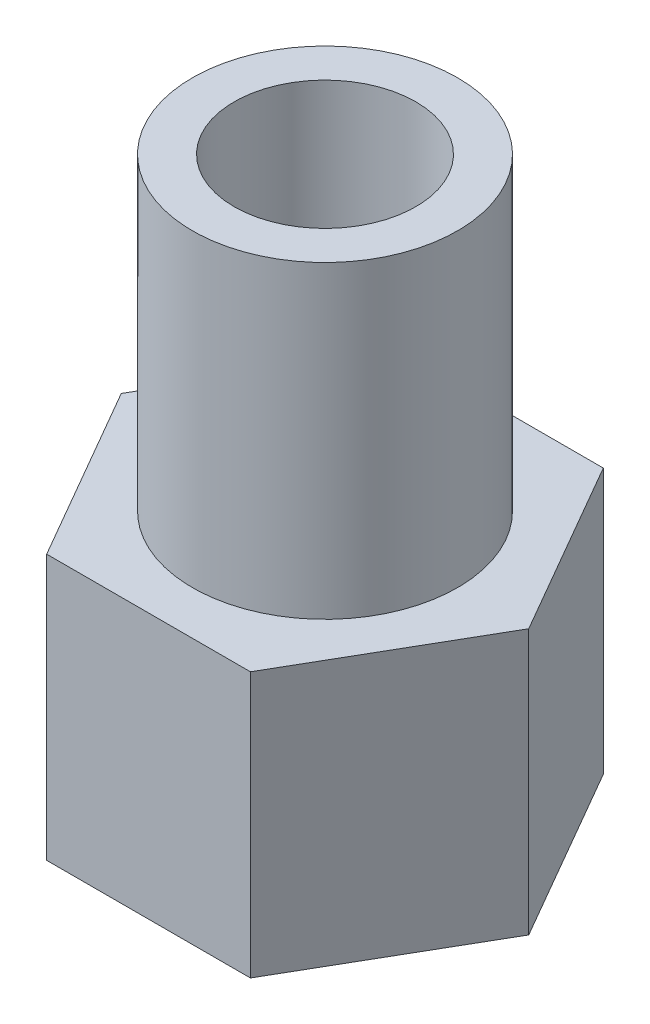
ISO-10303-21;
HEADER;
FILE_DESCRIPTION(('STEP AP214'),'2;1');
FILE_NAME('part.step','',(''),(''),'','','');
FILE_SCHEMA(('AUTOMOTIVE_DESIGN { 1 0 10303 214 1 1 1 1 }'));
ENDSEC;
DATA;
#1=APPLICATION_CONTEXT('core data for automotive mechanical design processes');
#2=APPLICATION_PROTOCOL_DEFINITION('international standard','automotive_design',2000,#1);
#3=PRODUCT_CONTEXT('',#1,'mechanical');
#4=PRODUCT('Part','Part','',(#3));
#5=PRODUCT_RELATED_PRODUCT_CATEGORY('part','',(#4));
#6=PRODUCT_DEFINITION_FORMATION('','',#4);
#7=PRODUCT_DEFINITION_CONTEXT('part definition',#1,'design');
#8=PRODUCT_DEFINITION('design','',#6,#7);
#9=PRODUCT_DEFINITION_SHAPE('','',#8);
#10=(LENGTH_UNIT() NAMED_UNIT(*) SI_UNIT(.MILLI.,.METRE.));
#11=(NAMED_UNIT(*) PLANE_ANGLE_UNIT() SI_UNIT($,.RADIAN.));
#12=(NAMED_UNIT(*) SI_UNIT($,.STERADIAN.) SOLID_ANGLE_UNIT());
#13=UNCERTAINTY_MEASURE_WITH_UNIT(LENGTH_MEASURE(1.E-05),#10,'distance_accuracy_value','');
#14=(GEOMETRIC_REPRESENTATION_CONTEXT(3) GLOBAL_UNCERTAINTY_ASSIGNED_CONTEXT((#13)) GLOBAL_UNIT_ASSIGNED_CONTEXT((#10,
#11,#12)) REPRESENTATION_CONTEXT('',''));
#15=CARTESIAN_POINT('',(0.,0.,0.));
#16=DIRECTION('',(0.,0.,1.));
#17=DIRECTION('',(1.,0.,0.));
#18=AXIS2_PLACEMENT_3D('',#15,#16,#17);
#19=CARTESIAN_POINT('',(0.,9.525,0.));
#20=DIRECTION('',(0.,1.,0.));
#21=DIRECTION('',(0.,0.,1.));
#22=AXIS2_PLACEMENT_3D('',#19,#20,#21);
#23=PLANE('',#22);
#24=CARTESIAN_POINT('',(0.,9.52500000003,0.));
#25=DIRECTION('',(0.,-1.,0.));
#26=DIRECTION('',(0.,0.,-1.));
#27=AXIS2_PLACEMENT_3D('',#24,#25,#26);
#28=CIRCLE('',#27,4.7625);
#29=CARTESIAN_POINT('',(0.,9.52500000003,-4.7625));
#30=VERTEX_POINT('',#29);
#31=EDGE_CURVE('E20',#30,#30,#28,.F.);
#32=ORIENTED_EDGE('',*,*,#31,.F.);
#33=EDGE_LOOP('',(#32));
#34=FACE_BOUND('',#33,.T.);
#35=DIRECTION('',(0.50000000000019,0.,-0.866025403784329));
#36=VECTOR('',#35,1.);
#37=CARTESIAN_POINT('',(-3.65884186094,9.525,-6.3373));
#38=LINE('',#37,#36);
#39=CARTESIAN_POINT('',(-3.65884186123562,9.525,-6.33730000027601));
#40=VERTEX_POINT('',#39);
#41=CARTESIAN_POINT('',(-7.31768372158863,9.525,-2.97582824296916E-10));
#42=VERTEX_POINT('',#41);
#43=EDGE_CURVE('E111',#40,#42,#38,.F.);
#44=ORIENTED_EDGE('',*,*,#43,.T.);
#45=DIRECTION('',(-0.50000000000019,0.,-0.866025403784329));
#46=VECTOR('',#45,1.);
#47=CARTESIAN_POINT('',(-7.31768372187,9.525,0.));
#48=LINE('',#47,#46);
#49=CARTESIAN_POINT('',(-3.6588418609598,9.525,6.33730000034042));
#50=VERTEX_POINT('',#49);
#51=EDGE_CURVE('E106',#42,#50,#48,.F.);
#52=ORIENTED_EDGE('',*,*,#51,.T.);
#53=DIRECTION('',(-1.,0.,0.));
#54=VECTOR('',#53,1.);
#55=CARTESIAN_POINT('',(-3.65884186094,9.525,6.3373));
#56=LINE('',#55,#54);
#57=CARTESIAN_POINT('',(3.65884186123562,9.525,6.33730000045351));
#58=VERTEX_POINT('',#57);
#59=EDGE_CURVE('E72',#50,#58,#56,.F.);
#60=ORIENTED_EDGE('',*,*,#59,.T.);
#61=DIRECTION('',(-0.50000000000019,0.,0.866025403784329));
#62=VECTOR('',#61,1.);
#63=CARTESIAN_POINT('',(3.65884186094,9.525,6.3373));
#64=LINE('',#63,#62);
#65=CARTESIAN_POINT('',(7.31768372158863,9.525,2.97582678169549E-10));
#66=VERTEX_POINT('',#65);
#67=EDGE_CURVE('E71',#58,#66,#64,.F.);
#68=ORIENTED_EDGE('',*,*,#67,.T.);
#69=DIRECTION('',(0.50000000000019,0.,0.866025403784329));
#70=VECTOR('',#69,1.);
#71=CARTESIAN_POINT('',(7.31768372187,9.525,0.));
#72=LINE('',#71,#70);
#73=CARTESIAN_POINT('',(3.6588418610723,9.525,-6.33730000034042));
#74=VERTEX_POINT('',#73);
#75=EDGE_CURVE('E68',#66,#74,#72,.F.);
#76=ORIENTED_EDGE('',*,*,#75,.T.);
#77=DIRECTION('',(1.,0.,0.));
#78=VECTOR('',#77,1.);
#79=CARTESIAN_POINT('',(3.65884186094,9.525,-6.3373));
#80=LINE('',#79,#78);
#81=EDGE_CURVE('E116',#74,#40,#80,.F.);
#82=ORIENTED_EDGE('',*,*,#81,.T.);
#83=EDGE_LOOP('',(#44,#52,#60,#68,#76,#82));
#84=FACE_BOUND('',#83,.T.);
#85=ADVANCED_FACE('F17',(#34,#84),#23,.T.);
#86=CARTESIAN_POINT('',(0.,20.6248,0.));
#87=DIRECTION('',(0.,-1.,0.));
#88=DIRECTION('',(0.,0.,-1.));
#89=AXIS2_PLACEMENT_3D('',#86,#87,#88);
#90=CYLINDRICAL_SURFACE('',#89,4.7625);
#91=ORIENTED_EDGE('',*,*,#31,.T.);
#92=EDGE_LOOP('',(#91));
#93=FACE_BOUND('',#92,.T.);
#94=CARTESIAN_POINT('',(0.,20.6248,0.));
#95=DIRECTION('',(0.,-1.,0.));
#96=DIRECTION('',(0.,0.,-1.));
#97=AXIS2_PLACEMENT_3D('',#94,#95,#96);
#98=CIRCLE('',#97,4.7625);
#99=CARTESIAN_POINT('',(0.,20.6248,-4.7625));
#100=VERTEX_POINT('',#99);
#101=EDGE_CURVE('E94',#100,#100,#98,.F.);
#102=ORIENTED_EDGE('',*,*,#101,.F.);
#103=EDGE_LOOP('',(#102));
#104=FACE_BOUND('',#103,.T.);
#105=ADVANCED_FACE('F223',(#93,#104),#90,.T.);
#106=CARTESIAN_POINT('',(3.65884186094,9.525,6.3373));
#107=DIRECTION('',(-0.866025403784329,0.,-0.50000000000019));
#108=DIRECTION('',(-0.50000000000019,0.,0.866025403784329));
#109=AXIS2_PLACEMENT_3D('',#106,#107,#108);
#110=PLANE('',#109);
#111=DIRECTION('',(0.,1.,0.));
#112=VECTOR('',#111,1.);
#113=CARTESIAN_POINT('',(7.3176837220986,9.525,3.95954338144703E-10));
#114=LINE('',#113,#112);
#115=CARTESIAN_POINT('',(7.31768372170363,-2.79398899849514E-10,4.94519666478076E-10));
#116=VERTEX_POINT('',#115);
#117=EDGE_CURVE('E77',#116,#66,#114,.T.);
#118=ORIENTED_EDGE('',*,*,#117,.T.);
#119=ORIENTED_EDGE('',*,*,#67,.F.);
#120=DIRECTION('',(0.,1.,0.));
#121=VECTOR('',#120,1.);
#122=CARTESIAN_POINT('',(3.65884186141,9.525,6.3373));
#123=LINE('',#122,#121);
#124=CARTESIAN_POINT('',(3.65884186071625,-2.79398032487777E-10,6.33730000019702));
#125=VERTEX_POINT('',#124);
#126=EDGE_CURVE('E96',#58,#125,#123,.F.);
#127=ORIENTED_EDGE('',*,*,#126,.T.);
#128=DIRECTION('',(0.500000000093205,0.,-0.866025403730627));
#129=VECTOR('',#128,1.);
#130=CARTESIAN_POINT('',(3.65884186003,0.,6.3373));
#131=LINE('',#130,#129);
#132=EDGE_CURVE('E88',#125,#116,#131,.T.);
#133=ORIENTED_EDGE('',*,*,#132,.T.);
#134=EDGE_LOOP('',(#118,#119,#127,#133));
#135=FACE_BOUND('',#134,.T.);
#136=ADVANCED_FACE('F87',(#135),#110,.F.);
#137=CARTESIAN_POINT('',(7.31768372187,9.525,0.));
#138=DIRECTION('',(-0.866025403784329,0.,0.50000000000019));
#139=DIRECTION('',(0.50000000000019,0.,0.866025403784329));
#140=AXIS2_PLACEMENT_3D('',#137,#138,#139);
#141=PLANE('',#140);
#142=DIRECTION('',(0.,1.,0.));
#143=VECTOR('',#142,1.);
#144=CARTESIAN_POINT('',(3.65884186139,9.525,-6.3373));
#145=LINE('',#144,#143);
#146=CARTESIAN_POINT('',(3.6588418610673,-2.79398032487777E-10,-6.33729999996542));
#147=VERTEX_POINT('',#146);
#148=EDGE_CURVE('E84',#147,#74,#145,.T.);
#149=ORIENTED_EDGE('',*,*,#148,.T.);
#150=ORIENTED_EDGE('',*,*,#75,.F.);
#151=ORIENTED_EDGE('',*,*,#117,.F.);
#152=DIRECTION('',(-0.499999999907336,0.,-0.866025403837938));
#153=VECTOR('',#152,1.);
#154=CARTESIAN_POINT('',(7.31768372142,0.,7.87746756714E-10));
#155=LINE('',#154,#153);
#156=EDGE_CURVE('E99',#116,#147,#155,.T.);
#157=ORIENTED_EDGE('',*,*,#156,.T.);
#158=EDGE_LOOP('',(#149,#150,#151,#157));
#159=FACE_BOUND('',#158,.T.);
#160=ADVANCED_FACE('F81',(#159),#141,.F.);
#161=CARTESIAN_POINT('',(3.65884186094,9.525,-6.3373));
#162=DIRECTION('',(0.,0.,1.));
#163=DIRECTION('',(1.,0.,0.));
#164=AXIS2_PLACEMENT_3D('',#161,#162,#163);
#165=PLANE('',#164);
#166=DIRECTION('',(0.,1.,0.));
#167=VECTOR('',#166,1.);
#168=CARTESIAN_POINT('',(-3.6588418607125,9.525,-6.33730000039404));
#169=LINE('',#168,#167);
#170=CARTESIAN_POINT('',(-3.65884186100465,-2.79397165126039E-10,-6.33729999990101));
#171=VERTEX_POINT('',#170);
#172=EDGE_CURVE('E113',#171,#40,#169,.T.);
#173=ORIENTED_EDGE('',*,*,#172,.T.);
#174=ORIENTED_EDGE('',*,*,#81,.F.);
#175=ORIENTED_EDGE('',*,*,#148,.F.);
#176=DIRECTION('',(1.,0.,0.));
#177=VECTOR('',#176,1.);
#178=CARTESIAN_POINT('',(0.,0.,-6.33729999921));
#179=LINE('',#178,#177);
#180=EDGE_CURVE('E127',#147,#171,#179,.F.);
#181=ORIENTED_EDGE('',*,*,#180,.T.);
#182=EDGE_LOOP('',(#173,#174,#175,#181));
#183=FACE_BOUND('',#182,.T.);
#184=ADVANCED_FACE('F125',(#183),#165,.F.);
#185=CARTESIAN_POINT('',(-3.65884186094,9.525,-6.3373));
#186=DIRECTION('',(0.866025403784329,0.,0.50000000000019));
#187=DIRECTION('',(0.50000000000019,0.,-0.866025403784329));
#188=AXIS2_PLACEMENT_3D('',#185,#186,#187);
#189=PLANE('',#188);
#190=DIRECTION('',(0.,1.,0.));
#191=VECTOR('',#190,1.);
#192=CARTESIAN_POINT('',(-7.3176837220986,9.525,-3.95954841722088E-10));
#193=LINE('',#192,#191);
#194=CARTESIAN_POINT('',(-7.31768372170363,-2.79398032487777E-10,-4.94519004770535E-10));
#195=VERTEX_POINT('',#194);
#196=EDGE_CURVE('E108',#195,#42,#193,.T.);
#197=ORIENTED_EDGE('',*,*,#196,.T.);
#198=ORIENTED_EDGE('',*,*,#43,.F.);
#199=ORIENTED_EDGE('',*,*,#172,.F.);
#200=DIRECTION('',(-0.500000000093205,0.,0.866025403730627));
#201=VECTOR('',#200,1.);
#202=CARTESIAN_POINT('',(-3.65884186003,0.,-6.3373));
#203=LINE('',#202,#201);
#204=EDGE_CURVE('E129',#171,#195,#203,.T.);
#205=ORIENTED_EDGE('',*,*,#204,.T.);
#206=EDGE_LOOP('',(#197,#198,#199,#205));
#207=FACE_BOUND('',#206,.T.);
#208=ADVANCED_FACE('F121',(#207),#189,.F.);
#209=CARTESIAN_POINT('',(-7.31768372187,9.525,0.));
#210=DIRECTION('',(0.866025403784329,0.,-0.50000000000019));
#211=DIRECTION('',(-0.50000000000019,0.,-0.866025403784329));
#212=AXIS2_PLACEMENT_3D('',#209,#210,#211);
#213=PLANE('',#212);
#214=DIRECTION('',(0.,1.,0.));
#215=VECTOR('',#214,1.);
#216=CARTESIAN_POINT('',(-3.65884186094,9.525,6.3373));
#217=LINE('',#216,#215);
#218=CARTESIAN_POINT('',(-3.6588418608423,-2.79396297764301E-10,6.33730000016292));
#219=VERTEX_POINT('',#218);
#220=EDGE_CURVE('E35',#219,#50,#217,.T.);
#221=ORIENTED_EDGE('',*,*,#220,.T.);
#222=ORIENTED_EDGE('',*,*,#51,.F.);
#223=ORIENTED_EDGE('',*,*,#196,.F.);
#224=DIRECTION('',(0.49999999990671,0.,0.8660254038383));
#225=VECTOR('',#224,1.);
#226=CARTESIAN_POINT('',(-7.31768372142,0.,-7.87746756714E-10));
#227=LINE('',#226,#225);
#228=EDGE_CURVE('E131',#195,#219,#227,.T.);
#229=ORIENTED_EDGE('',*,*,#228,.T.);
#230=EDGE_LOOP('',(#221,#222,#223,#229));
#231=FACE_BOUND('',#230,.T.);
#232=ADVANCED_FACE('F140',(#231),#213,.F.);
#233=CARTESIAN_POINT('',(-3.65884186094,9.525,6.3373));
#234=DIRECTION('',(0.,0.,-1.));
#235=DIRECTION('',(-1.,0.,0.));
#236=AXIS2_PLACEMENT_3D('',#233,#234,#235);
#237=PLANE('',#236);
#238=ORIENTED_EDGE('',*,*,#126,.F.);
#239=ORIENTED_EDGE('',*,*,#59,.F.);
#240=ORIENTED_EDGE('',*,*,#220,.F.);
#241=DIRECTION('',(1.,0.,0.));
#242=VECTOR('',#241,1.);
#243=CARTESIAN_POINT('',(0.,0.,6.3373));
#244=LINE('',#243,#242);
#245=EDGE_CURVE('E93',#219,#125,#244,.T.);
#246=ORIENTED_EDGE('',*,*,#245,.T.);
#247=EDGE_LOOP('',(#238,#239,#240,#246));
#248=FACE_BOUND('',#247,.T.);
#249=ADVANCED_FACE('F136',(#248),#237,.F.);
#250=CARTESIAN_POINT('',(0.,20.6248,0.));
#251=DIRECTION('',(0.,1.,0.));
#252=DIRECTION('',(0.,0.,1.));
#253=AXIS2_PLACEMENT_3D('',#250,#251,#252);
#254=PLANE('',#253);
#255=CARTESIAN_POINT('',(0.,20.6248000003,0.));
#256=DIRECTION('',(0.,1.,0.));
#257=DIRECTION('',(0.,0.,1.));
#258=AXIS2_PLACEMENT_3D('',#255,#256,#257);
#259=CIRCLE('',#258,3.2639);
#260=CARTESIAN_POINT('',(0.,20.6248000003,3.2639));
#261=VERTEX_POINT('',#260);
#262=EDGE_CURVE('E26',#261,#261,#259,.F.);
#263=ORIENTED_EDGE('',*,*,#262,.T.);
#264=EDGE_LOOP('',(#263));
#265=FACE_BOUND('',#264,.T.);
#266=ORIENTED_EDGE('',*,*,#101,.T.);
#267=EDGE_LOOP('',(#266));
#268=FACE_BOUND('',#267,.T.);
#269=ADVANCED_FACE('F148',(#265,#268),#254,.T.);
#270=CARTESIAN_POINT('',(0.,0.,0.));
#271=DIRECTION('',(0.,1.,0.));
#272=DIRECTION('',(0.,0.,1.));
#273=AXIS2_PLACEMENT_3D('',#270,#271,#272);
#274=PLANE('',#273);
#275=CARTESIAN_POINT('',(0.,0.,0.));
#276=DIRECTION('',(0.,1.,0.));
#277=DIRECTION('',(0.,0.,1.));
#278=AXIS2_PLACEMENT_3D('',#275,#276,#277);
#279=CIRCLE('',#278,3.2639);
#280=CARTESIAN_POINT('',(0.,0.,3.2639));
#281=VERTEX_POINT('',#280);
#282=EDGE_CURVE('E11',#281,#281,#279,.T.);
#283=ORIENTED_EDGE('',*,*,#282,.T.);
#284=EDGE_LOOP('',(#283));
#285=FACE_BOUND('',#284,.T.);
#286=ORIENTED_EDGE('',*,*,#228,.F.);
#287=ORIENTED_EDGE('',*,*,#204,.F.);
#288=ORIENTED_EDGE('',*,*,#180,.F.);
#289=ORIENTED_EDGE('',*,*,#156,.F.);
#290=ORIENTED_EDGE('',*,*,#132,.F.);
#291=ORIENTED_EDGE('',*,*,#245,.F.);
#292=EDGE_LOOP('',(#286,#287,#288,#289,#290,#291));
#293=FACE_BOUND('',#292,.T.);
#294=ADVANCED_FACE('F138',(#285,#293),#274,.F.);
#295=CARTESIAN_POINT('',(0.,0.,0.));
#296=DIRECTION('',(0.,1.,0.));
#297=DIRECTION('',(0.,0.,1.));
#298=AXIS2_PLACEMENT_3D('',#295,#296,#297);
#299=CYLINDRICAL_SURFACE('',#298,3.2639);
#300=ORIENTED_EDGE('',*,*,#262,.F.);
#301=EDGE_LOOP('',(#300));
#302=FACE_BOUND('',#301,.T.);
#303=ORIENTED_EDGE('',*,*,#282,.F.);
#304=EDGE_LOOP('',(#303));
#305=FACE_BOUND('',#304,.T.);
#306=ADVANCED_FACE('F151',(#302,#305),#299,.F.);
#307=CLOSED_SHELL('',(#85,#105,#136,#160,#184,#208,#232,#249,#269,#294,#306));
#308=MANIFOLD_SOLID_BREP('B1',#307);
#309=ADVANCED_BREP_SHAPE_REPRESENTATION('',(#18,#308),#14);
#310=SHAPE_DEFINITION_REPRESENTATION(#9,#309);
ENDSEC;
END-ISO-10303-21;
